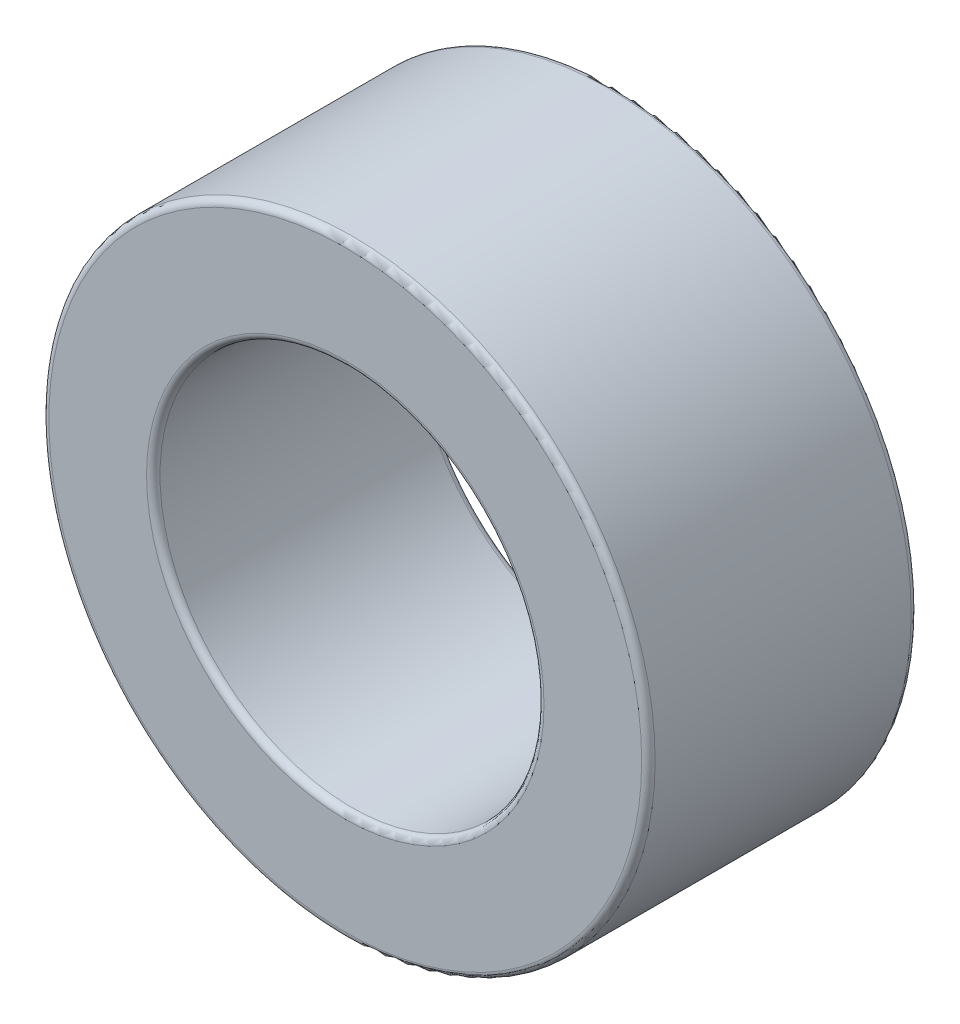
ISO-10303-21;
HEADER;
FILE_DESCRIPTION(('STEP AP214'),'2;1');
FILE_NAME('part.step','',(''),(''),'','','');
FILE_SCHEMA(('AUTOMOTIVE_DESIGN { 1 0 10303 214 1 1 1 1 }'));
ENDSEC;
DATA;
#1=APPLICATION_CONTEXT('core data for automotive mechanical design processes');
#2=APPLICATION_PROTOCOL_DEFINITION('international standard','automotive_design',2000,#1);
#3=PRODUCT_CONTEXT('',#1,'mechanical');
#4=PRODUCT('Part','Part','',(#3));
#5=PRODUCT_RELATED_PRODUCT_CATEGORY('part','',(#4));
#6=PRODUCT_DEFINITION_FORMATION('','',#4);
#7=PRODUCT_DEFINITION_CONTEXT('part definition',#1,'design');
#8=PRODUCT_DEFINITION('design','',#6,#7);
#9=PRODUCT_DEFINITION_SHAPE('','',#8);
#10=(LENGTH_UNIT() NAMED_UNIT(*) SI_UNIT(.MILLI.,.METRE.));
#11=(NAMED_UNIT(*) PLANE_ANGLE_UNIT() SI_UNIT($,.RADIAN.));
#12=(NAMED_UNIT(*) SI_UNIT($,.STERADIAN.) SOLID_ANGLE_UNIT());
#13=UNCERTAINTY_MEASURE_WITH_UNIT(LENGTH_MEASURE(1.E-05),#10,'distance_accuracy_value','');
#14=(GEOMETRIC_REPRESENTATION_CONTEXT(3) GLOBAL_UNCERTAINTY_ASSIGNED_CONTEXT((#13)) GLOBAL_UNIT_ASSIGNED_CONTEXT((#10,
#11,#12)) REPRESENTATION_CONTEXT('',''));
#15=CARTESIAN_POINT('',(0.,0.,0.));
#16=DIRECTION('',(0.,0.,1.));
#17=DIRECTION('',(1.,0.,0.));
#18=AXIS2_PLACEMENT_3D('',#15,#16,#17);
#19=CARTESIAN_POINT('',(0.,0.,4.));
#20=DIRECTION('',(0.,0.,1.));
#21=DIRECTION('',(1.,0.,0.));
#22=AXIS2_PLACEMENT_3D('',#19,#20,#21);
#23=PLANE('',#22);
#24=CARTESIAN_POINT('',(0.,0.,4.));
#25=DIRECTION('',(0.,0.,1.));
#26=DIRECTION('',(1.,0.,0.));
#27=AXIS2_PLACEMENT_3D('',#24,#25,#26);
#28=CIRCLE('',#27,2.95);
#29=CARTESIAN_POINT('',(2.95,0.,4.));
#30=VERTEX_POINT('',#29);
#31=EDGE_CURVE('E50',#30,#30,#28,.F.);
#32=ORIENTED_EDGE('',*,*,#31,.T.);
#33=EDGE_LOOP('',(#32));
#34=FACE_BOUND('',#33,.T.);
#35=CARTESIAN_POINT('',(0.,0.,4.));
#36=DIRECTION('',(0.,0.,1.));
#37=DIRECTION('',(1.,0.,0.));
#38=AXIS2_PLACEMENT_3D('',#35,#36,#37);
#39=CIRCLE('',#38,4.4);
#40=CARTESIAN_POINT('',(4.4,0.,4.));
#41=VERTEX_POINT('',#40);
#42=EDGE_CURVE('E53',#41,#41,#39,.T.);
#43=ORIENTED_EDGE('',*,*,#42,.T.);
#44=EDGE_LOOP('',(#43));
#45=FACE_BOUND('',#44,.T.);
#46=ADVANCED_FACE('F30',(#34,#45),#23,.T.);
#47=CARTESIAN_POINT('',(0.,0.,0.));
#48=DIRECTION('',(0.,0.,1.));
#49=DIRECTION('',(1.,0.,0.));
#50=AXIS2_PLACEMENT_3D('',#47,#48,#49);
#51=PLANE('',#50);
#52=CARTESIAN_POINT('',(0.,0.,0.));
#53=DIRECTION('',(0.,0.,1.));
#54=DIRECTION('',(1.,0.,0.));
#55=AXIS2_PLACEMENT_3D('',#52,#53,#54);
#56=CIRCLE('',#55,2.95);
#57=CARTESIAN_POINT('',(2.95,0.,0.));
#58=VERTEX_POINT('',#57);
#59=EDGE_CURVE('E41',#58,#58,#56,.T.);
#60=ORIENTED_EDGE('',*,*,#59,.T.);
#61=EDGE_LOOP('',(#60));
#62=FACE_BOUND('',#61,.T.);
#63=CARTESIAN_POINT('',(0.,0.,0.));
#64=DIRECTION('',(0.,0.,1.));
#65=DIRECTION('',(1.,0.,0.));
#66=AXIS2_PLACEMENT_3D('',#63,#64,#65);
#67=CIRCLE('',#66,4.4);
#68=CARTESIAN_POINT('',(4.4,0.,0.));
#69=VERTEX_POINT('',#68);
#70=EDGE_CURVE('E45',#69,#69,#67,.F.);
#71=ORIENTED_EDGE('',*,*,#70,.T.);
#72=EDGE_LOOP('',(#71));
#73=FACE_BOUND('',#72,.T.);
#74=ADVANCED_FACE('F73',(#62,#73),#51,.F.);
#75=CARTESIAN_POINT('',(0.,0.,4.));
#76=DIRECTION('',(0.,0.,-1.));
#77=DIRECTION('',(-1.,0.,0.));
#78=AXIS2_PLACEMENT_3D('',#75,#76,#77);
#79=CYLINDRICAL_SURFACE('',#78,4.5);
#80=CARTESIAN_POINT('',(0.,0.,0.0999999999999998));
#81=DIRECTION('',(0.,0.,1.));
#82=DIRECTION('',(1.,0.,0.));
#83=AXIS2_PLACEMENT_3D('',#80,#81,#82);
#84=CIRCLE('',#83,4.5);
#85=CARTESIAN_POINT('',(4.5,0.,0.0999999999999998));
#86=VERTEX_POINT('',#85);
#87=EDGE_CURVE('E10',#86,#86,#84,.T.);
#88=ORIENTED_EDGE('',*,*,#87,.T.);
#89=EDGE_LOOP('',(#88));
#90=FACE_BOUND('',#89,.T.);
#91=CARTESIAN_POINT('',(0.,0.,3.9));
#92=DIRECTION('',(0.,0.,1.));
#93=DIRECTION('',(1.,0.,0.));
#94=AXIS2_PLACEMENT_3D('',#91,#92,#93);
#95=CIRCLE('',#94,4.5);
#96=CARTESIAN_POINT('',(4.5,0.,3.9));
#97=VERTEX_POINT('',#96);
#98=EDGE_CURVE('E37',#97,#97,#95,.F.);
#99=ORIENTED_EDGE('',*,*,#98,.T.);
#100=EDGE_LOOP('',(#99));
#101=FACE_BOUND('',#100,.T.);
#102=ADVANCED_FACE('F76',(#90,#101),#79,.T.);
#103=CARTESIAN_POINT('',(0.,0.,4.));
#104=DIRECTION('',(0.,0.,-1.));
#105=DIRECTION('',(-1.,0.,0.));
#106=AXIS2_PLACEMENT_3D('',#103,#104,#105);
#107=CYLINDRICAL_SURFACE('',#106,2.85);
#108=CARTESIAN_POINT('',(0.,0.,3.9));
#109=DIRECTION('',(0.,0.,1.));
#110=DIRECTION('',(1.,0.,0.));
#111=AXIS2_PLACEMENT_3D('',#108,#109,#110);
#112=CIRCLE('',#111,2.85);
#113=CARTESIAN_POINT('',(2.85,0.,3.9));
#114=VERTEX_POINT('',#113);
#115=EDGE_CURVE('E56',#114,#114,#112,.T.);
#116=ORIENTED_EDGE('',*,*,#115,.T.);
#117=EDGE_LOOP('',(#116));
#118=FACE_BOUND('',#117,.T.);
#119=CARTESIAN_POINT('',(0.,0.,0.0999999999999998));
#120=DIRECTION('',(0.,0.,1.));
#121=DIRECTION('',(1.,0.,0.));
#122=AXIS2_PLACEMENT_3D('',#119,#120,#121);
#123=CIRCLE('',#122,2.85);
#124=CARTESIAN_POINT('',(2.85,0.,0.0999999999999998));
#125=VERTEX_POINT('',#124);
#126=EDGE_CURVE('E59',#125,#125,#123,.F.);
#127=ORIENTED_EDGE('',*,*,#126,.T.);
#128=EDGE_LOOP('',(#127));
#129=FACE_BOUND('',#128,.T.);
#130=ADVANCED_FACE('F63',(#118,#129),#107,.F.);
#131=CARTESIAN_POINT('',(0.,0.,3.9));
#132=DIRECTION('',(0.,0.,1.));
#133=DIRECTION('',(1.,0.,0.));
#134=AXIS2_PLACEMENT_3D('',#131,#132,#133);
#135=TOROIDAL_SURFACE('',#134,2.95,0.1);
#136=ORIENTED_EDGE('',*,*,#31,.F.);
#137=EDGE_LOOP('',(#136));
#138=FACE_BOUND('',#137,.T.);
#139=ORIENTED_EDGE('',*,*,#115,.F.);
#140=EDGE_LOOP('',(#139));
#141=FACE_BOUND('',#140,.T.);
#142=ADVANCED_FACE('F69',(#138,#141),#135,.T.);
#143=CARTESIAN_POINT('',(0.,0.,0.0999999999999998));
#144=DIRECTION('',(0.,0.,1.));
#145=DIRECTION('',(1.,0.,0.));
#146=AXIS2_PLACEMENT_3D('',#143,#144,#145);
#147=TOROIDAL_SURFACE('',#146,2.95,0.1);
#148=ORIENTED_EDGE('',*,*,#126,.F.);
#149=EDGE_LOOP('',(#148));
#150=FACE_BOUND('',#149,.T.);
#151=ORIENTED_EDGE('',*,*,#59,.F.);
#152=EDGE_LOOP('',(#151));
#153=FACE_BOUND('',#152,.T.);
#154=ADVANCED_FACE('F65',(#150,#153),#147,.T.);
#155=CARTESIAN_POINT('',(0.,0.,0.0999999999999998));
#156=DIRECTION('',(0.,0.,1.));
#157=DIRECTION('',(1.,0.,0.));
#158=AXIS2_PLACEMENT_3D('',#155,#156,#157);
#159=TOROIDAL_SURFACE('',#158,4.4,0.1);
#160=ORIENTED_EDGE('',*,*,#70,.F.);
#161=EDGE_LOOP('',(#160));
#162=FACE_BOUND('',#161,.T.);
#163=ORIENTED_EDGE('',*,*,#87,.F.);
#164=EDGE_LOOP('',(#163));
#165=FACE_BOUND('',#164,.T.);
#166=ADVANCED_FACE('F68',(#162,#165),#159,.T.);
#167=CARTESIAN_POINT('',(0.,0.,3.9));
#168=DIRECTION('',(0.,0.,1.));
#169=DIRECTION('',(1.,0.,0.));
#170=AXIS2_PLACEMENT_3D('',#167,#168,#169);
#171=TOROIDAL_SURFACE('',#170,4.4,0.1);
#172=ORIENTED_EDGE('',*,*,#98,.F.);
#173=EDGE_LOOP('',(#172));
#174=FACE_BOUND('',#173,.T.);
#175=ORIENTED_EDGE('',*,*,#42,.F.);
#176=EDGE_LOOP('',(#175));
#177=FACE_BOUND('',#176,.T.);
#178=ADVANCED_FACE('F32',(#174,#177),#171,.T.);
#179=CLOSED_SHELL('',(#46,#74,#102,#130,#142,#154,#166,#178));
#180=MANIFOLD_SOLID_BREP('B2',#179);
#181=ADVANCED_BREP_SHAPE_REPRESENTATION('',(#18,#180),#14);
#182=SHAPE_DEFINITION_REPRESENTATION(#9,#181);
ENDSEC;
END-ISO-10303-21;
